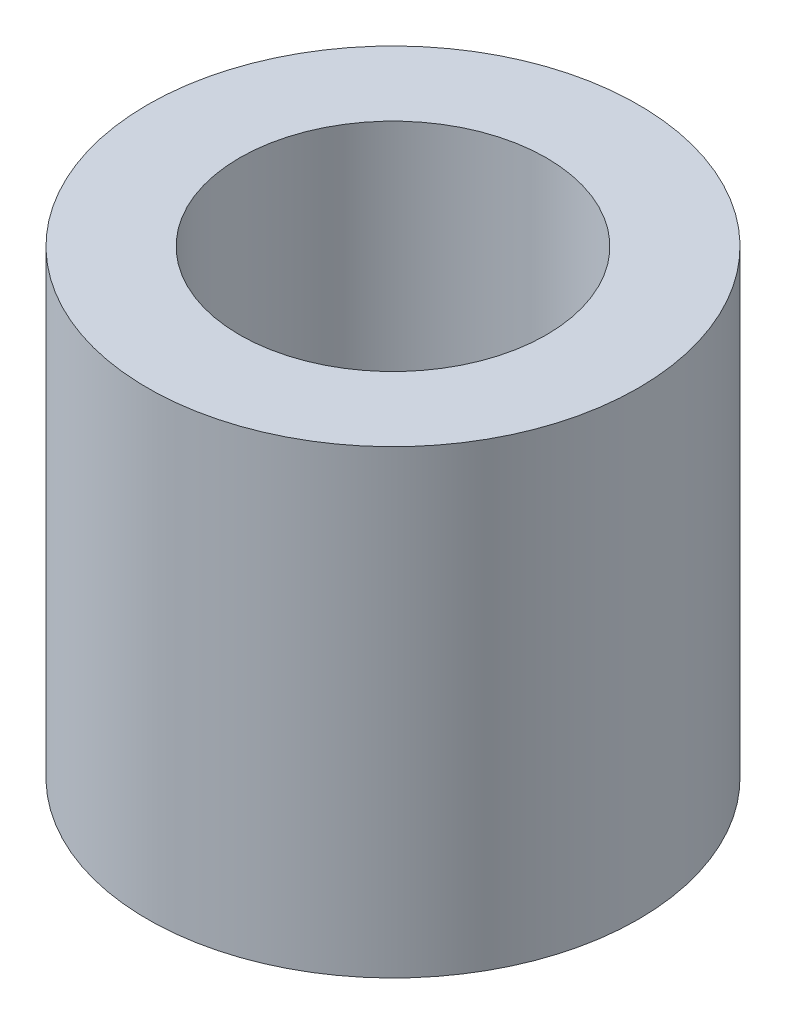
ISO-10303-21;
HEADER;
FILE_DESCRIPTION(('STEP AP214'),'2;1');
FILE_NAME('part.step','',(''),(''),'','','');
FILE_SCHEMA(('AUTOMOTIVE_DESIGN { 1 0 10303 214 1 1 1 1 }'));
ENDSEC;
DATA;
#1=APPLICATION_CONTEXT('core data for automotive mechanical design processes');
#2=APPLICATION_PROTOCOL_DEFINITION('international standard','automotive_design',2000,#1);
#3=PRODUCT_CONTEXT('',#1,'mechanical');
#4=PRODUCT('Part','Part','',(#3));
#5=PRODUCT_RELATED_PRODUCT_CATEGORY('part','',(#4));
#6=PRODUCT_DEFINITION_FORMATION('','',#4);
#7=PRODUCT_DEFINITION_CONTEXT('part definition',#1,'design');
#8=PRODUCT_DEFINITION('design','',#6,#7);
#9=PRODUCT_DEFINITION_SHAPE('','',#8);
#10=(LENGTH_UNIT() NAMED_UNIT(*) SI_UNIT(.MILLI.,.METRE.));
#11=(NAMED_UNIT(*) PLANE_ANGLE_UNIT() SI_UNIT($,.RADIAN.));
#12=(NAMED_UNIT(*) SI_UNIT($,.STERADIAN.) SOLID_ANGLE_UNIT());
#13=UNCERTAINTY_MEASURE_WITH_UNIT(LENGTH_MEASURE(1.E-05),#10,'distance_accuracy_value','');
#14=(GEOMETRIC_REPRESENTATION_CONTEXT(3) GLOBAL_UNCERTAINTY_ASSIGNED_CONTEXT((#13)) GLOBAL_UNIT_ASSIGNED_CONTEXT((#10,
#11,#12)) REPRESENTATION_CONTEXT('',''));
#15=CARTESIAN_POINT('',(0.,0.,0.));
#16=DIRECTION('',(0.,0.,1.));
#17=DIRECTION('',(1.,0.,0.));
#18=AXIS2_PLACEMENT_3D('',#15,#16,#17);
#19=CARTESIAN_POINT('',(0.,15.,0.));
#20=DIRECTION('',(0.,1.,0.));
#21=DIRECTION('',(0.,0.,1.));
#22=AXIS2_PLACEMENT_3D('',#19,#20,#21);
#23=PLANE('',#22);
#24=CARTESIAN_POINT('',(0.,15.,0.));
#25=DIRECTION('',(0.,1.,0.));
#26=DIRECTION('',(1.,0.,0.));
#27=AXIS2_PLACEMENT_3D('',#24,#25,#26);
#28=CIRCLE('',#27,8.);
#29=CARTESIAN_POINT('',(8.,15.,0.));
#30=VERTEX_POINT('',#29);
#31=EDGE_CURVE('E11',#30,#30,#28,.T.);
#32=ORIENTED_EDGE('',*,*,#31,.T.);
#33=EDGE_LOOP('',(#32));
#34=FACE_BOUND('',#33,.T.);
#35=CARTESIAN_POINT('',(0.,15.,0.));
#36=DIRECTION('',(0.,1.,0.));
#37=DIRECTION('',(0.,0.,1.));
#38=AXIS2_PLACEMENT_3D('',#35,#36,#37);
#39=CIRCLE('',#38,5.);
#40=CARTESIAN_POINT('',(0.,15.,5.));
#41=VERTEX_POINT('',#40);
#42=EDGE_CURVE('E50',#41,#41,#39,.T.);
#43=ORIENTED_EDGE('',*,*,#42,.F.);
#44=EDGE_LOOP('',(#43));
#45=FACE_BOUND('',#44,.T.);
#46=ADVANCED_FACE('F39',(#34,#45),#23,.T.);
#47=CARTESIAN_POINT('',(0.,0.,0.));
#48=DIRECTION('',(0.,1.,0.));
#49=DIRECTION('',(0.,0.,1.));
#50=AXIS2_PLACEMENT_3D('',#47,#48,#49);
#51=PLANE('',#50);
#52=CARTESIAN_POINT('',(0.,0.,0.));
#53=DIRECTION('',(0.,1.,0.));
#54=DIRECTION('',(1.,0.,0.));
#55=AXIS2_PLACEMENT_3D('',#52,#53,#54);
#56=CIRCLE('',#55,8.);
#57=CARTESIAN_POINT('',(8.,0.,0.));
#58=VERTEX_POINT('',#57);
#59=EDGE_CURVE('E43',#58,#58,#56,.T.);
#60=ORIENTED_EDGE('',*,*,#59,.F.);
#61=EDGE_LOOP('',(#60));
#62=FACE_BOUND('',#61,.T.);
#63=CARTESIAN_POINT('',(0.,0.,0.));
#64=DIRECTION('',(0.,1.,0.));
#65=DIRECTION('',(0.,0.,1.));
#66=AXIS2_PLACEMENT_3D('',#63,#64,#65);
#67=CIRCLE('',#66,5.);
#68=CARTESIAN_POINT('',(0.,0.,5.));
#69=VERTEX_POINT('',#68);
#70=EDGE_CURVE('E52',#69,#69,#67,.T.);
#71=ORIENTED_EDGE('',*,*,#70,.T.);
#72=EDGE_LOOP('',(#71));
#73=FACE_BOUND('',#72,.T.);
#74=ADVANCED_FACE('F62',(#62,#73),#51,.F.);
#75=CARTESIAN_POINT('',(0.,15.,0.));
#76=DIRECTION('',(0.,-1.,0.));
#77=DIRECTION('',(0.,0.,-1.));
#78=AXIS2_PLACEMENT_3D('',#75,#76,#77);
#79=CYLINDRICAL_SURFACE('',#78,8.);
#80=ORIENTED_EDGE('',*,*,#31,.F.);
#81=EDGE_LOOP('',(#80));
#82=FACE_BOUND('',#81,.T.);
#83=ORIENTED_EDGE('',*,*,#59,.T.);
#84=EDGE_LOOP('',(#83));
#85=FACE_BOUND('',#84,.T.);
#86=ADVANCED_FACE('F41',(#82,#85),#79,.T.);
#87=CARTESIAN_POINT('',(0.,15.,0.));
#88=DIRECTION('',(0.,-1.,0.));
#89=DIRECTION('',(0.,0.,-1.));
#90=AXIS2_PLACEMENT_3D('',#87,#88,#89);
#91=CYLINDRICAL_SURFACE('',#90,5.);
#92=ORIENTED_EDGE('',*,*,#42,.T.);
#93=EDGE_LOOP('',(#92));
#94=FACE_BOUND('',#93,.T.);
#95=ORIENTED_EDGE('',*,*,#70,.F.);
#96=EDGE_LOOP('',(#95));
#97=FACE_BOUND('',#96,.T.);
#98=ADVANCED_FACE('F58',(#94,#97),#91,.F.);
#99=CLOSED_SHELL('',(#46,#74,#86,#98));
#100=MANIFOLD_SOLID_BREP('B2',#99);
#101=ADVANCED_BREP_SHAPE_REPRESENTATION('',(#18,#100),#14);
#102=SHAPE_DEFINITION_REPRESENTATION(#9,#101);
ENDSEC;
END-ISO-10303-21;
